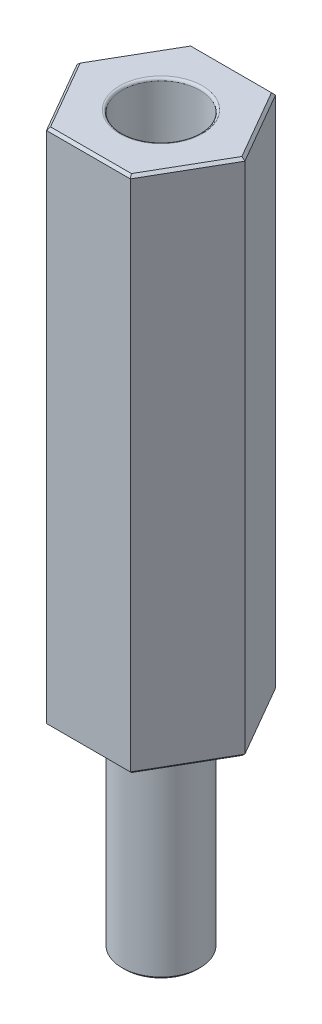
ISO-10303-21;
HEADER;
FILE_DESCRIPTION(('STEP AP214'),'2;1');
FILE_NAME('part.step','',(''),(''),'','','');
FILE_SCHEMA(('AUTOMOTIVE_DESIGN { 1 0 10303 214 1 1 1 1 }'));
ENDSEC;
DATA;
#1=APPLICATION_CONTEXT('core data for automotive mechanical design processes');
#2=APPLICATION_PROTOCOL_DEFINITION('international standard','automotive_design',2000,#1);
#3=PRODUCT_CONTEXT('',#1,'mechanical');
#4=PRODUCT('Part','Part','',(#3));
#5=PRODUCT_RELATED_PRODUCT_CATEGORY('part','',(#4));
#6=PRODUCT_DEFINITION_FORMATION('','',#4);
#7=PRODUCT_DEFINITION_CONTEXT('part definition',#1,'design');
#8=PRODUCT_DEFINITION('design','',#6,#7);
#9=PRODUCT_DEFINITION_SHAPE('','',#8);
#10=(LENGTH_UNIT() NAMED_UNIT(*) SI_UNIT(.MILLI.,.METRE.));
#11=(NAMED_UNIT(*) PLANE_ANGLE_UNIT() SI_UNIT($,.RADIAN.));
#12=(NAMED_UNIT(*) SI_UNIT($,.STERADIAN.) SOLID_ANGLE_UNIT());
#13=UNCERTAINTY_MEASURE_WITH_UNIT(LENGTH_MEASURE(1.E-05),#10,'distance_accuracy_value','');
#14=(GEOMETRIC_REPRESENTATION_CONTEXT(3) GLOBAL_UNCERTAINTY_ASSIGNED_CONTEXT((#13)) GLOBAL_UNIT_ASSIGNED_CONTEXT((#10,
#11,#12)) REPRESENTATION_CONTEXT('',''));
#15=CARTESIAN_POINT('',(0.,0.,0.));
#16=DIRECTION('',(0.,0.,1.));
#17=DIRECTION('',(1.,0.,0.));
#18=AXIS2_PLACEMENT_3D('',#15,#16,#17);
#19=CARTESIAN_POINT('',(1.61658075373097,20.,2.8));
#20=DIRECTION('',(0.,0.,1.));
#21=DIRECTION('',(1.,0.,0.));
#22=AXIS2_PLACEMENT_3D('',#19,#20,#21);
#23=PLANE('',#22);
#24=DIRECTION('',(0.,-1.,0.));
#25=VECTOR('',#24,1.);
#26=CARTESIAN_POINT('',(1.61658075373097,20.,2.8));
#27=LINE('',#26,#25);
#28=CARTESIAN_POINT('',(1.61658075373097,19.9,2.8));
#29=VERTEX_POINT('',#28);
#30=CARTESIAN_POINT('',(1.61658075373097,0.100000000000003,2.8));
#31=VERTEX_POINT('',#30);
#32=EDGE_CURVE('E143',#29,#31,#27,.T.);
#33=ORIENTED_EDGE('',*,*,#32,.F.);
#34=DIRECTION('',(-1.,0.,0.));
#35=VECTOR('',#34,1.);
#36=CARTESIAN_POINT('',(-1.61658075373094,19.9,2.8));
#37=LINE('',#36,#35);
#38=CARTESIAN_POINT('',(-1.61658075373094,19.9,2.8));
#39=VERTEX_POINT('',#38);
#40=EDGE_CURVE('E203',#29,#39,#37,.T.);
#41=ORIENTED_EDGE('',*,*,#40,.T.);
#42=DIRECTION('',(0.,-1.,0.));
#43=VECTOR('',#42,1.);
#44=CARTESIAN_POINT('',(-1.61658075373094,20.,2.8));
#45=LINE('',#44,#43);
#46=CARTESIAN_POINT('',(-1.61658075373094,0.100000000000003,2.8));
#47=VERTEX_POINT('',#46);
#48=EDGE_CURVE('E133',#39,#47,#45,.T.);
#49=ORIENTED_EDGE('',*,*,#48,.T.);
#50=DIRECTION('',(1.,0.,0.));
#51=VECTOR('',#50,1.);
#52=CARTESIAN_POINT('',(1.61658075373097,0.100000000000003,2.8));
#53=LINE('',#52,#51);
#54=EDGE_CURVE('E201',#47,#31,#53,.T.);
#55=ORIENTED_EDGE('',*,*,#54,.T.);
#56=EDGE_LOOP('',(#33,#41,#49,#55));
#57=FACE_BOUND('',#56,.T.);
#58=ADVANCED_FACE('F33',(#57),#23,.T.);
#59=CARTESIAN_POINT('',(3.23316150746192,20.,0.));
#60=DIRECTION('',(0.866025403784439,0.,0.5));
#61=DIRECTION('',(0.5,0.,-0.866025403784439));
#62=AXIS2_PLACEMENT_3D('',#59,#60,#61);
#63=PLANE('',#62);
#64=DIRECTION('',(0.,-1.,0.));
#65=VECTOR('',#64,1.);
#66=CARTESIAN_POINT('',(3.23316150746192,20.,0.));
#67=LINE('',#66,#65);
#68=CARTESIAN_POINT('',(3.23316150746192,19.9,0.));
#69=VERTEX_POINT('',#68);
#70=CARTESIAN_POINT('',(3.23316150746192,0.100000000000003,0.));
#71=VERTEX_POINT('',#70);
#72=EDGE_CURVE('E147',#69,#71,#67,.T.);
#73=ORIENTED_EDGE('',*,*,#72,.F.);
#74=DIRECTION('',(-0.5,0.,0.866025403784439));
#75=VECTOR('',#74,1.);
#76=CARTESIAN_POINT('',(1.61658075373097,19.9,2.8));
#77=LINE('',#76,#75);
#78=EDGE_CURVE('E199',#69,#29,#77,.T.);
#79=ORIENTED_EDGE('',*,*,#78,.T.);
#80=ORIENTED_EDGE('',*,*,#32,.T.);
#81=DIRECTION('',(0.5,0.,-0.866025403784439));
#82=VECTOR('',#81,1.);
#83=CARTESIAN_POINT('',(3.23316150746192,0.100000000000003,0.));
#84=LINE('',#83,#82);
#85=EDGE_CURVE('E197',#31,#71,#84,.T.);
#86=ORIENTED_EDGE('',*,*,#85,.T.);
#87=EDGE_LOOP('',(#73,#79,#80,#86));
#88=FACE_BOUND('',#87,.T.);
#89=ADVANCED_FACE('F260',(#88),#63,.T.);
#90=CARTESIAN_POINT('',(1.61658075373096,20.,-2.8));
#91=DIRECTION('',(0.866025403784438,0.,-0.500000000000002));
#92=DIRECTION('',(-0.500000000000002,0.,-0.866025403784438));
#93=AXIS2_PLACEMENT_3D('',#90,#91,#92);
#94=PLANE('',#93);
#95=DIRECTION('',(0.,-1.,0.));
#96=VECTOR('',#95,1.);
#97=CARTESIAN_POINT('',(1.61658075373096,20.,-2.8));
#98=LINE('',#97,#96);
#99=CARTESIAN_POINT('',(1.61658075373096,19.9,-2.8));
#100=VERTEX_POINT('',#99);
#101=CARTESIAN_POINT('',(1.61658075373096,0.100000000000003,-2.8));
#102=VERTEX_POINT('',#101);
#103=EDGE_CURVE('E150',#100,#102,#98,.T.);
#104=ORIENTED_EDGE('',*,*,#103,.F.);
#105=DIRECTION('',(0.500000000000002,0.,0.866025403784438));
#106=VECTOR('',#105,1.);
#107=CARTESIAN_POINT('',(3.23316150746192,19.9,0.));
#108=LINE('',#107,#106);
#109=EDGE_CURVE('E195',#100,#69,#108,.T.);
#110=ORIENTED_EDGE('',*,*,#109,.T.);
#111=ORIENTED_EDGE('',*,*,#72,.T.);
#112=DIRECTION('',(-0.500000000000002,0.,-0.866025403784438));
#113=VECTOR('',#112,1.);
#114=CARTESIAN_POINT('',(1.61658075373096,0.100000000000003,-2.8));
#115=LINE('',#114,#113);
#116=EDGE_CURVE('E193',#71,#102,#115,.T.);
#117=ORIENTED_EDGE('',*,*,#116,.T.);
#118=EDGE_LOOP('',(#104,#110,#111,#117));
#119=FACE_BOUND('',#118,.T.);
#120=ADVANCED_FACE('F318',(#119),#94,.T.);
#121=CARTESIAN_POINT('',(-1.61658075373094,20.,-2.8));
#122=DIRECTION('',(0.,0.,-1.));
#123=DIRECTION('',(-1.,0.,0.));
#124=AXIS2_PLACEMENT_3D('',#121,#122,#123);
#125=PLANE('',#124);
#126=DIRECTION('',(0.,-1.,0.));
#127=VECTOR('',#126,1.);
#128=CARTESIAN_POINT('',(-1.61658075373094,20.,-2.8));
#129=LINE('',#128,#127);
#130=CARTESIAN_POINT('',(-1.61658075373094,19.9,-2.8));
#131=VERTEX_POINT('',#130);
#132=CARTESIAN_POINT('',(-1.61658075373094,0.100000000000003,-2.8));
#133=VERTEX_POINT('',#132);
#134=EDGE_CURVE('E153',#131,#133,#129,.T.);
#135=ORIENTED_EDGE('',*,*,#134,.F.);
#136=DIRECTION('',(1.,0.,0.));
#137=VECTOR('',#136,1.);
#138=CARTESIAN_POINT('',(1.61658075373096,19.9,-2.8));
#139=LINE('',#138,#137);
#140=EDGE_CURVE('E191',#131,#100,#139,.T.);
#141=ORIENTED_EDGE('',*,*,#140,.T.);
#142=ORIENTED_EDGE('',*,*,#103,.T.);
#143=DIRECTION('',(-1.,0.,0.));
#144=VECTOR('',#143,1.);
#145=CARTESIAN_POINT('',(-1.61658075373094,0.100000000000003,-2.8));
#146=LINE('',#145,#144);
#147=EDGE_CURVE('E188',#102,#133,#146,.T.);
#148=ORIENTED_EDGE('',*,*,#147,.T.);
#149=EDGE_LOOP('',(#135,#141,#142,#148));
#150=FACE_BOUND('',#149,.T.);
#151=ADVANCED_FACE('F285',(#150),#125,.T.);
#152=CARTESIAN_POINT('',(-3.23316150746189,20.,0.));
#153=DIRECTION('',(-0.866025403784439,0.,-0.5));
#154=DIRECTION('',(-0.5,0.,0.866025403784439));
#155=AXIS2_PLACEMENT_3D('',#152,#153,#154);
#156=PLANE('',#155);
#157=DIRECTION('',(0.,-1.,0.));
#158=VECTOR('',#157,1.);
#159=CARTESIAN_POINT('',(-3.23316150746189,20.,0.));
#160=LINE('',#159,#158);
#161=CARTESIAN_POINT('',(-3.23316150746189,19.9,0.));
#162=VERTEX_POINT('',#161);
#163=CARTESIAN_POINT('',(-3.23316150746189,0.100000000000003,0.));
#164=VERTEX_POINT('',#163);
#165=EDGE_CURVE('E137',#162,#164,#160,.T.);
#166=ORIENTED_EDGE('',*,*,#165,.F.);
#167=DIRECTION('',(0.5,0.,-0.866025403784439));
#168=VECTOR('',#167,1.);
#169=CARTESIAN_POINT('',(-1.61658075373094,19.9,-2.8));
#170=LINE('',#169,#168);
#171=EDGE_CURVE('E186',#162,#131,#170,.T.);
#172=ORIENTED_EDGE('',*,*,#171,.T.);
#173=ORIENTED_EDGE('',*,*,#134,.T.);
#174=DIRECTION('',(-0.5,0.,0.866025403784439));
#175=VECTOR('',#174,1.);
#176=CARTESIAN_POINT('',(-3.23316150746189,0.100000000000003,0.));
#177=LINE('',#176,#175);
#178=EDGE_CURVE('E184',#133,#164,#177,.T.);
#179=ORIENTED_EDGE('',*,*,#178,.T.);
#180=EDGE_LOOP('',(#166,#172,#173,#179));
#181=FACE_BOUND('',#180,.T.);
#182=ADVANCED_FACE('F276',(#181),#156,.T.);
#183=CARTESIAN_POINT('',(-1.61658075373094,20.,2.8));
#184=DIRECTION('',(-0.866025403784439,0.,0.5));
#185=DIRECTION('',(0.5,0.,0.866025403784439));
#186=AXIS2_PLACEMENT_3D('',#183,#184,#185);
#187=PLANE('',#186);
#188=ORIENTED_EDGE('',*,*,#48,.F.);
#189=DIRECTION('',(-0.5,0.,-0.866025403784439));
#190=VECTOR('',#189,1.);
#191=CARTESIAN_POINT('',(-3.23316150746189,19.9,0.));
#192=LINE('',#191,#190);
#193=EDGE_CURVE('E168',#39,#162,#192,.T.);
#194=ORIENTED_EDGE('',*,*,#193,.T.);
#195=ORIENTED_EDGE('',*,*,#165,.T.);
#196=DIRECTION('',(0.5,0.,0.866025403784439));
#197=VECTOR('',#196,1.);
#198=CARTESIAN_POINT('',(-1.61658075373094,0.100000000000003,2.8));
#199=LINE('',#198,#197);
#200=EDGE_CURVE('E166',#164,#47,#199,.T.);
#201=ORIENTED_EDGE('',*,*,#200,.T.);
#202=EDGE_LOOP('',(#188,#194,#195,#201));
#203=FACE_BOUND('',#202,.T.);
#204=ADVANCED_FACE('F273',(#203),#187,.T.);
#205=CARTESIAN_POINT('',(0.,20.,0.));
#206=DIRECTION('',(0.,-1.,0.));
#207=DIRECTION('',(0.,0.,-1.));
#208=AXIS2_PLACEMENT_3D('',#205,#206,#207);
#209=PLANE('',#208);
#210=DIRECTION('',(-0.5,0.,0.866025403784439));
#211=VECTOR('',#210,1.);
#212=CARTESIAN_POINT('',(-3.14655896708345,20.,0.0499999999999996));
#213=LINE('',#212,#211);
#214=CARTESIAN_POINT('',(-1.55884572681198,20.,-2.7));
#215=VERTEX_POINT('',#214);
#216=CARTESIAN_POINT('',(-3.11769145362397,20.,0.));
#217=VERTEX_POINT('',#216);
#218=EDGE_CURVE('E179',#215,#217,#213,.T.);
#219=ORIENTED_EDGE('',*,*,#218,.T.);
#220=DIRECTION('',(0.5,0.,0.866025403784439));
#221=VECTOR('',#220,1.);
#222=CARTESIAN_POINT('',(-1.5299782133525,20.,2.75));
#223=LINE('',#222,#221);
#224=CARTESIAN_POINT('',(-1.55884572681198,20.,2.7));
#225=VERTEX_POINT('',#224);
#226=EDGE_CURVE('E181',#217,#225,#223,.T.);
#227=ORIENTED_EDGE('',*,*,#226,.T.);
#228=DIRECTION('',(1.,0.,0.));
#229=VECTOR('',#228,1.);
#230=CARTESIAN_POINT('',(1.61658075373097,20.,2.7));
#231=LINE('',#230,#229);
#232=CARTESIAN_POINT('',(1.55884572681201,20.,2.7));
#233=VERTEX_POINT('',#232);
#234=EDGE_CURVE('E171',#225,#233,#231,.T.);
#235=ORIENTED_EDGE('',*,*,#234,.T.);
#236=DIRECTION('',(0.5,0.,-0.866025403784439));
#237=VECTOR('',#236,1.);
#238=CARTESIAN_POINT('',(3.14655896708348,20.,-0.0500000000000003));
#239=LINE('',#238,#237);
#240=CARTESIAN_POINT('',(3.117691453624,20.,0.));
#241=VERTEX_POINT('',#240);
#242=EDGE_CURVE('E173',#233,#241,#239,.T.);
#243=ORIENTED_EDGE('',*,*,#242,.T.);
#244=DIRECTION('',(-0.500000000000002,0.,-0.866025403784438));
#245=VECTOR('',#244,1.);
#246=CARTESIAN_POINT('',(1.52997821335252,20.,-2.75));
#247=LINE('',#246,#245);
#248=CARTESIAN_POINT('',(1.558845726812,20.,-2.7));
#249=VERTEX_POINT('',#248);
#250=EDGE_CURVE('E175',#241,#249,#247,.T.);
#251=ORIENTED_EDGE('',*,*,#250,.T.);
#252=DIRECTION('',(-1.,0.,0.));
#253=VECTOR('',#252,1.);
#254=CARTESIAN_POINT('',(-1.61658075373094,20.,-2.7));
#255=LINE('',#254,#253);
#256=EDGE_CURVE('E177',#249,#215,#255,.T.);
#257=ORIENTED_EDGE('',*,*,#256,.T.);
#258=EDGE_LOOP('',(#219,#227,#235,#243,#251,#257));
#259=FACE_BOUND('',#258,.T.);
#260=CARTESIAN_POINT('',(0.,20.,0.));
#261=DIRECTION('',(0.,-1.,0.));
#262=DIRECTION('',(0.,0.,-1.));
#263=AXIS2_PLACEMENT_3D('',#260,#261,#262);
#264=CIRCLE('',#263,1.6);
#265=CARTESIAN_POINT('',(0.,20.,-1.6));
#266=VERTEX_POINT('',#265);
#267=EDGE_CURVE('E163',#266,#266,#264,.T.);
#268=ORIENTED_EDGE('',*,*,#267,.T.);
#269=EDGE_LOOP('',(#268));
#270=FACE_BOUND('',#269,.T.);
#271=ADVANCED_FACE('F300',(#259,#270),#209,.F.);
#272=CARTESIAN_POINT('',(0.,0.,0.));
#273=DIRECTION('',(0.,-1.,0.));
#274=DIRECTION('',(0.,0.,-1.));
#275=AXIS2_PLACEMENT_3D('',#272,#273,#274);
#276=PLANE('',#275);
#277=DIRECTION('',(0.5,0.,-0.866025403784439));
#278=VECTOR('',#277,1.);
#279=CARTESIAN_POINT('',(-2.33826859021797,0.,-1.34999999999999));
#280=LINE('',#279,#278);
#281=CARTESIAN_POINT('',(-3.11769145362396,0.,0.));
#282=VERTEX_POINT('',#281);
#283=CARTESIAN_POINT('',(-1.55884572681198,0.,-2.7));
#284=VERTEX_POINT('',#283);
#285=EDGE_CURVE('E42',#282,#284,#280,.T.);
#286=ORIENTED_EDGE('',*,*,#285,.T.);
#287=DIRECTION('',(1.,0.,0.));
#288=VECTOR('',#287,1.);
#289=CARTESIAN_POINT('',(0.,0.,-2.7));
#290=LINE('',#289,#288);
#291=CARTESIAN_POINT('',(1.558845726812,0.,-2.7));
#292=VERTEX_POINT('',#291);
#293=EDGE_CURVE('E11',#284,#292,#290,.T.);
#294=ORIENTED_EDGE('',*,*,#293,.T.);
#295=DIRECTION('',(0.500000000000002,0.,0.866025403784438));
#296=VECTOR('',#295,1.);
#297=CARTESIAN_POINT('',(2.33826859021799,0.,-1.35000000000001));
#298=LINE('',#297,#296);
#299=CARTESIAN_POINT('',(3.11769145362399,0.,0.));
#300=VERTEX_POINT('',#299);
#301=EDGE_CURVE('E213',#292,#300,#298,.T.);
#302=ORIENTED_EDGE('',*,*,#301,.T.);
#303=DIRECTION('',(-0.5,0.,0.866025403784439));
#304=VECTOR('',#303,1.);
#305=CARTESIAN_POINT('',(2.338268590218,0.,1.35000000000001));
#306=LINE('',#305,#304);
#307=CARTESIAN_POINT('',(1.55884572681201,0.,2.7));
#308=VERTEX_POINT('',#307);
#309=EDGE_CURVE('E211',#300,#308,#306,.T.);
#310=ORIENTED_EDGE('',*,*,#309,.T.);
#311=DIRECTION('',(-1.,0.,0.));
#312=VECTOR('',#311,1.);
#313=CARTESIAN_POINT('',(0.,0.,2.7));
#314=LINE('',#313,#312);
#315=CARTESIAN_POINT('',(-1.55884572681198,0.,2.7));
#316=VERTEX_POINT('',#315);
#317=EDGE_CURVE('E215',#308,#316,#314,.T.);
#318=ORIENTED_EDGE('',*,*,#317,.T.);
#319=DIRECTION('',(-0.5,0.,-0.866025403784439));
#320=VECTOR('',#319,1.);
#321=CARTESIAN_POINT('',(-2.33826859021797,0.,1.34999999999999));
#322=LINE('',#321,#320);
#323=EDGE_CURVE('E53',#316,#282,#322,.T.);
#324=ORIENTED_EDGE('',*,*,#323,.T.);
#325=EDGE_LOOP('',(#286,#294,#302,#310,#318,#324));
#326=FACE_BOUND('',#325,.T.);
#327=CARTESIAN_POINT('',(0.,0.,0.));
#328=DIRECTION('',(0.,-1.,0.));
#329=DIRECTION('',(0.,0.,-1.));
#330=AXIS2_PLACEMENT_3D('',#327,#328,#329);
#331=CIRCLE('',#330,1.5);
#332=CARTESIAN_POINT('',(0.,0.,-1.5));
#333=VERTEX_POINT('',#332);
#334=EDGE_CURVE('E146',#333,#333,#331,.T.);
#335=ORIENTED_EDGE('',*,*,#334,.F.);
#336=EDGE_LOOP('',(#335));
#337=FACE_BOUND('',#336,.T.);
#338=ADVANCED_FACE('F296',(#326,#337),#276,.T.);
#339=CARTESIAN_POINT('',(0.,0.,0.));
#340=DIRECTION('',(0.,-1.,0.));
#341=DIRECTION('',(1.,0.,0.));
#342=AXIS2_PLACEMENT_3D('',#339,#340,#341);
#343=CYLINDRICAL_SURFACE('',#342,1.5);
#344=CARTESIAN_POINT('',(0.,-7.9,0.));
#345=DIRECTION('',(0.,-1.,0.));
#346=DIRECTION('',(1.,0.,0.));
#347=AXIS2_PLACEMENT_3D('',#344,#345,#346);
#348=CIRCLE('',#347,1.5);
#349=CARTESIAN_POINT('',(1.5,-7.9,0.));
#350=VERTEX_POINT('',#349);
#351=EDGE_CURVE('E208',#350,#350,#348,.F.);
#352=ORIENTED_EDGE('',*,*,#351,.T.);
#353=EDGE_LOOP('',(#352));
#354=FACE_BOUND('',#353,.T.);
#355=ORIENTED_EDGE('',*,*,#334,.T.);
#356=EDGE_LOOP('',(#355));
#357=FACE_BOUND('',#356,.T.);
#358=ADVANCED_FACE('F299',(#354,#357),#343,.T.);
#359=CARTESIAN_POINT('',(0.,-8.,0.));
#360=DIRECTION('',(0.,-1.,0.));
#361=DIRECTION('',(1.,0.,0.));
#362=AXIS2_PLACEMENT_3D('',#359,#360,#361);
#363=PLANE('',#362);
#364=CARTESIAN_POINT('',(0.,-8.,0.));
#365=DIRECTION('',(0.,-1.,0.));
#366=DIRECTION('',(1.,0.,0.));
#367=AXIS2_PLACEMENT_3D('',#364,#365,#366);
#368=CIRCLE('',#367,1.4);
#369=CARTESIAN_POINT('',(1.4,-8.,0.));
#370=VERTEX_POINT('',#369);
#371=EDGE_CURVE('E205',#370,#370,#368,.T.);
#372=ORIENTED_EDGE('',*,*,#371,.T.);
#373=EDGE_LOOP('',(#372));
#374=FACE_BOUND('',#373,.T.);
#375=ADVANCED_FACE('F127',(#374),#363,.T.);
#376=CARTESIAN_POINT('',(0.,12.,0.));
#377=DIRECTION('',(0.,1.,0.));
#378=DIRECTION('',(0.,0.,1.));
#379=AXIS2_PLACEMENT_3D('',#376,#377,#378);
#380=CONICAL_SURFACE('',#379,1.5,1.02974425867665);
#381=CARTESIAN_POINT('',(0.,11.0987090714587,0.));
#382=VERTEX_POINT('',#381);
#383=VERTEX_LOOP('',#382);
#384=FACE_BOUND('',#383,.T.);
#385=CARTESIAN_POINT('',(0.,12.,0.));
#386=DIRECTION('',(0.,1.,0.));
#387=DIRECTION('',(0.,0.,1.));
#388=AXIS2_PLACEMENT_3D('',#385,#386,#387);
#389=CIRCLE('',#388,1.5);
#390=CARTESIAN_POINT('',(0.,12.,1.5));
#391=VERTEX_POINT('',#390);
#392=EDGE_CURVE('E131',#391,#391,#389,.T.);
#393=ORIENTED_EDGE('',*,*,#392,.T.);
#394=EDGE_LOOP('',(#393));
#395=FACE_BOUND('',#394,.T.);
#396=ADVANCED_FACE('F123',(#384,#395),#380,.F.);
#397=CARTESIAN_POINT('',(0.,20.,0.));
#398=DIRECTION('',(0.,1.,0.));
#399=DIRECTION('',(0.,0.,1.));
#400=AXIS2_PLACEMENT_3D('',#397,#398,#399);
#401=CYLINDRICAL_SURFACE('',#400,1.5);
#402=CARTESIAN_POINT('',(0.,19.9,0.));
#403=DIRECTION('',(0.,-1.,0.));
#404=DIRECTION('',(0.,0.,-1.));
#405=AXIS2_PLACEMENT_3D('',#402,#403,#404);
#406=CIRCLE('',#405,1.5);
#407=CARTESIAN_POINT('',(0.,19.9,-1.5));
#408=VERTEX_POINT('',#407);
#409=EDGE_CURVE('E160',#408,#408,#406,.F.);
#410=ORIENTED_EDGE('',*,*,#409,.T.);
#411=EDGE_LOOP('',(#410));
#412=FACE_BOUND('',#411,.T.);
#413=ORIENTED_EDGE('',*,*,#392,.F.);
#414=EDGE_LOOP('',(#413));
#415=FACE_BOUND('',#414,.T.);
#416=ADVANCED_FACE('F126',(#412,#415),#401,.F.);
#417=CARTESIAN_POINT('',(0.,19.9,0.));
#418=DIRECTION('',(0.,-1.,0.));
#419=DIRECTION('',(0.,0.,-1.));
#420=AXIS2_PLACEMENT_3D('',#417,#418,#419);
#421=TOROIDAL_SURFACE('',#420,1.6,0.1);
#422=ORIENTED_EDGE('',*,*,#267,.F.);
#423=EDGE_LOOP('',(#422));
#424=FACE_BOUND('',#423,.T.);
#425=ORIENTED_EDGE('',*,*,#409,.F.);
#426=EDGE_LOOP('',(#425));
#427=FACE_BOUND('',#426,.T.);
#428=ADVANCED_FACE('F323',(#424,#427),#421,.T.);
#429=CARTESIAN_POINT('',(1.61658075373096,19.9,-2.8));
#430=DIRECTION('',(0.612372435695794,0.707106781186547,-0.353553390593275));
#431=DIRECTION('',(-0.500000000000002,0.,-0.866025403784438));
#432=AXIS2_PLACEMENT_3D('',#429,#430,#431);
#433=PLANE('',#432);
#434=DIRECTION('',(-0.377964473009227,0.654653670707978,0.654653670707977));
#435=VECTOR('',#434,1.);
#436=CARTESIAN_POINT('',(1.61658075373096,19.9,-2.8));
#437=LINE('',#436,#435);
#438=EDGE_CURVE('E140',#249,#100,#437,.F.);
#439=ORIENTED_EDGE('',*,*,#438,.F.);
#440=ORIENTED_EDGE('',*,*,#250,.F.);
#441=DIRECTION('',(-0.755928946018454,0.654653670707978,0.));
#442=VECTOR('',#441,1.);
#443=CARTESIAN_POINT('',(3.23316150746192,19.9,0.));
#444=LINE('',#443,#442);
#445=EDGE_CURVE('E134',#69,#241,#444,.T.);
#446=ORIENTED_EDGE('',*,*,#445,.F.);
#447=ORIENTED_EDGE('',*,*,#109,.F.);
#448=EDGE_LOOP('',(#439,#440,#446,#447));
#449=FACE_BOUND('',#448,.T.);
#450=ADVANCED_FACE('F326',(#449),#433,.T.);
#451=CARTESIAN_POINT('',(3.23316150746192,19.9,0.));
#452=DIRECTION('',(0.612372435695795,0.707106781186547,0.353553390593274));
#453=DIRECTION('',(0.5,0.,-0.866025403784439));
#454=AXIS2_PLACEMENT_3D('',#451,#452,#453);
#455=PLANE('',#454);
#456=ORIENTED_EDGE('',*,*,#445,.T.);
#457=ORIENTED_EDGE('',*,*,#242,.F.);
#458=DIRECTION('',(-0.377964473009226,0.654653670707978,-0.654653670707978));
#459=VECTOR('',#458,1.);
#460=CARTESIAN_POINT('',(1.61658075373097,19.9,2.8));
#461=LINE('',#460,#459);
#462=EDGE_CURVE('E226',#29,#233,#461,.T.);
#463=ORIENTED_EDGE('',*,*,#462,.F.);
#464=ORIENTED_EDGE('',*,*,#78,.F.);
#465=EDGE_LOOP('',(#456,#457,#463,#464));
#466=FACE_BOUND('',#465,.T.);
#467=ADVANCED_FACE('F264',(#466),#455,.T.);
#468=CARTESIAN_POINT('',(-1.61658075373094,19.9,-2.8));
#469=DIRECTION('',(0.,0.707106781186547,-0.707106781186548));
#470=DIRECTION('',(-1.,0.,0.));
#471=AXIS2_PLACEMENT_3D('',#468,#469,#470);
#472=PLANE('',#471);
#473=ORIENTED_EDGE('',*,*,#438,.T.);
#474=ORIENTED_EDGE('',*,*,#140,.F.);
#475=DIRECTION('',(0.377964473009228,0.654653670707978,0.654653670707976));
#476=VECTOR('',#475,1.);
#477=CARTESIAN_POINT('',(-1.61658075373094,19.9,-2.8));
#478=LINE('',#477,#476);
#479=EDGE_CURVE('E223',#215,#131,#478,.F.);
#480=ORIENTED_EDGE('',*,*,#479,.F.);
#481=ORIENTED_EDGE('',*,*,#256,.F.);
#482=EDGE_LOOP('',(#473,#474,#480,#481));
#483=FACE_BOUND('',#482,.T.);
#484=ADVANCED_FACE('F339',(#483),#472,.T.);
#485=CARTESIAN_POINT('',(1.61658075373097,19.9,2.8));
#486=DIRECTION('',(0.,0.707106781186548,0.707106781186548));
#487=DIRECTION('',(1.,0.,0.));
#488=AXIS2_PLACEMENT_3D('',#485,#486,#487);
#489=PLANE('',#488);
#490=ORIENTED_EDGE('',*,*,#462,.T.);
#491=ORIENTED_EDGE('',*,*,#234,.F.);
#492=DIRECTION('',(-0.377964473009226,-0.654653670707978,0.654653670707978));
#493=VECTOR('',#492,1.);
#494=CARTESIAN_POINT('',(-1.15470053837924,20.7,2.));
#495=LINE('',#494,#493);
#496=EDGE_CURVE('E221',#39,#225,#495,.F.);
#497=ORIENTED_EDGE('',*,*,#496,.F.);
#498=ORIENTED_EDGE('',*,*,#40,.F.);
#499=EDGE_LOOP('',(#490,#491,#497,#498));
#500=FACE_BOUND('',#499,.T.);
#501=ADVANCED_FACE('F270',(#500),#489,.T.);
#502=CARTESIAN_POINT('',(-3.23316150746189,19.9,0.));
#503=DIRECTION('',(-0.612372435695795,0.707106781186547,-0.353553390593274));
#504=DIRECTION('',(-0.5,0.,0.866025403784439));
#505=AXIS2_PLACEMENT_3D('',#502,#503,#504);
#506=PLANE('',#505);
#507=ORIENTED_EDGE('',*,*,#479,.T.);
#508=ORIENTED_EDGE('',*,*,#171,.F.);
#509=DIRECTION('',(0.755928946018454,0.654653670707978,0.));
#510=VECTOR('',#509,1.);
#511=CARTESIAN_POINT('',(-3.23316150746189,19.9,0.));
#512=LINE('',#511,#510);
#513=EDGE_CURVE('E219',#217,#162,#512,.F.);
#514=ORIENTED_EDGE('',*,*,#513,.F.);
#515=ORIENTED_EDGE('',*,*,#218,.F.);
#516=EDGE_LOOP('',(#507,#508,#514,#515));
#517=FACE_BOUND('',#516,.T.);
#518=ADVANCED_FACE('F332',(#517),#506,.T.);
#519=CARTESIAN_POINT('',(-1.61658075373094,19.9,2.8));
#520=DIRECTION('',(-0.612372435695795,0.707106781186547,0.353553390593274));
#521=DIRECTION('',(0.5,0.,0.866025403784439));
#522=AXIS2_PLACEMENT_3D('',#519,#520,#521);
#523=PLANE('',#522);
#524=ORIENTED_EDGE('',*,*,#496,.T.);
#525=ORIENTED_EDGE('',*,*,#226,.F.);
#526=ORIENTED_EDGE('',*,*,#513,.T.);
#527=ORIENTED_EDGE('',*,*,#193,.F.);
#528=EDGE_LOOP('',(#524,#525,#526,#527));
#529=FACE_BOUND('',#528,.T.);
#530=ADVANCED_FACE('F328',(#529),#523,.T.);
#531=CARTESIAN_POINT('',(0.,-8.,0.));
#532=DIRECTION('',(0.,1.,0.));
#533=DIRECTION('',(-1.,0.,0.));
#534=AXIS2_PLACEMENT_3D('',#531,#532,#533);
#535=CONICAL_SURFACE('',#534,1.4,0.785398163397442);
#536=ORIENTED_EDGE('',*,*,#351,.F.);
#537=EDGE_LOOP('',(#536));
#538=FACE_BOUND('',#537,.T.);
#539=ORIENTED_EDGE('',*,*,#371,.F.);
#540=EDGE_LOOP('',(#539));
#541=FACE_BOUND('',#540,.T.);
#542=ADVANCED_FACE('F331',(#538,#541),#535,.T.);
#543=CARTESIAN_POINT('',(0.,0.,2.7));
#544=DIRECTION('',(0.,0.707106781186541,-0.707106781186554));
#545=DIRECTION('',(-1.,0.,0.));
#546=AXIS2_PLACEMENT_3D('',#543,#544,#545);
#547=PLANE('',#546);
#548=DIRECTION('',(-0.377964473009225,-0.654653670707983,-0.654653670707972));
#549=VECTOR('',#548,1.);
#550=CARTESIAN_POINT('',(1.33615348012458,-0.385714285714284,2.31428571428572));
#551=LINE('',#550,#549);
#552=EDGE_CURVE('E240',#31,#308,#551,.T.);
#553=ORIENTED_EDGE('',*,*,#552,.F.);
#554=ORIENTED_EDGE('',*,*,#54,.F.);
#555=DIRECTION('',(0.377964473009225,-0.654653670707984,-0.654653670707972));
#556=VECTOR('',#555,1.);
#557=CARTESIAN_POINT('',(-1.33615348012455,-0.385714285714284,2.31428571428572));
#558=LINE('',#557,#556);
#559=EDGE_CURVE('E37',#316,#47,#558,.F.);
#560=ORIENTED_EDGE('',*,*,#559,.F.);
#561=ORIENTED_EDGE('',*,*,#317,.F.);
#562=EDGE_LOOP('',(#553,#554,#560,#561));
#563=FACE_BOUND('',#562,.T.);
#564=ADVANCED_FACE('F35',(#563),#547,.F.);
#565=CARTESIAN_POINT('',(-2.33826859021797,0.,1.34999999999999));
#566=DIRECTION('',(0.6123724356958,0.707106781186541,-0.353553390593277));
#567=DIRECTION('',(-0.5,0.,-0.866025403784439));
#568=AXIS2_PLACEMENT_3D('',#565,#566,#567);
#569=PLANE('',#568);
#570=ORIENTED_EDGE('',*,*,#559,.T.);
#571=ORIENTED_EDGE('',*,*,#200,.F.);
#572=DIRECTION('',(0.755928946018449,-0.654653670707984,0.));
#573=VECTOR('',#572,1.);
#574=CARTESIAN_POINT('',(-2.67230696024912,-0.385714285714284,0.));
#575=LINE('',#574,#573);
#576=EDGE_CURVE('E238',#282,#164,#575,.F.);
#577=ORIENTED_EDGE('',*,*,#576,.F.);
#578=ORIENTED_EDGE('',*,*,#323,.F.);
#579=EDGE_LOOP('',(#570,#571,#577,#578));
#580=FACE_BOUND('',#579,.T.);
#581=ADVANCED_FACE('F250',(#580),#569,.F.);
#582=CARTESIAN_POINT('',(2.338268590218,0.,1.35000000000001));
#583=DIRECTION('',(-0.6123724356958,0.707106781186542,-0.353553390593276));
#584=DIRECTION('',(-0.5,0.,0.866025403784439));
#585=AXIS2_PLACEMENT_3D('',#582,#583,#584);
#586=PLANE('',#585);
#587=ORIENTED_EDGE('',*,*,#552,.T.);
#588=ORIENTED_EDGE('',*,*,#309,.F.);
#589=DIRECTION('',(0.755928946018449,0.654653670707984,0.));
#590=VECTOR('',#589,1.);
#591=CARTESIAN_POINT('',(2.67230696024915,-0.385714285714287,0.));
#592=LINE('',#591,#590);
#593=EDGE_CURVE('E235',#71,#300,#592,.F.);
#594=ORIENTED_EDGE('',*,*,#593,.F.);
#595=ORIENTED_EDGE('',*,*,#85,.F.);
#596=EDGE_LOOP('',(#587,#588,#594,#595));
#597=FACE_BOUND('',#596,.T.);
#598=ADVANCED_FACE('F357',(#597),#586,.F.);
#599=CARTESIAN_POINT('',(-2.33826859021797,0.,-1.34999999999999));
#600=DIRECTION('',(0.6123724356958,0.707106781186541,0.353553390593277));
#601=DIRECTION('',(0.5,0.,-0.866025403784439));
#602=AXIS2_PLACEMENT_3D('',#599,#600,#601);
#603=PLANE('',#602);
#604=ORIENTED_EDGE('',*,*,#576,.T.);
#605=ORIENTED_EDGE('',*,*,#178,.F.);
#606=DIRECTION('',(0.377964473009226,-0.654653670707984,0.654653670707971));
#607=VECTOR('',#606,1.);
#608=CARTESIAN_POINT('',(-1.33615348012455,-0.385714285714288,-2.31428571428572));
#609=LINE('',#608,#607);
#610=EDGE_CURVE('E233',#284,#133,#609,.F.);
#611=ORIENTED_EDGE('',*,*,#610,.F.);
#612=ORIENTED_EDGE('',*,*,#285,.F.);
#613=EDGE_LOOP('',(#604,#605,#611,#612));
#614=FACE_BOUND('',#613,.T.);
#615=ADVANCED_FACE('F281',(#614),#603,.F.);
#616=CARTESIAN_POINT('',(2.33826859021799,0.,-1.35000000000001));
#617=DIRECTION('',(-0.6123724356958,0.707106781186541,0.353553390593278));
#618=DIRECTION('',(0.500000000000002,0.,0.866025403784438));
#619=AXIS2_PLACEMENT_3D('',#616,#617,#618);
#620=PLANE('',#619);
#621=ORIENTED_EDGE('',*,*,#593,.T.);
#622=ORIENTED_EDGE('',*,*,#301,.F.);
#623=DIRECTION('',(0.377964473009223,0.654653670707985,-0.654653670707972));
#624=VECTOR('',#623,1.);
#625=CARTESIAN_POINT('',(1.33615348012458,-0.385714285714284,-2.31428571428572));
#626=LINE('',#625,#624);
#627=EDGE_CURVE('E231',#102,#292,#626,.F.);
#628=ORIENTED_EDGE('',*,*,#627,.F.);
#629=ORIENTED_EDGE('',*,*,#116,.F.);
#630=EDGE_LOOP('',(#621,#622,#628,#629));
#631=FACE_BOUND('',#630,.T.);
#632=ADVANCED_FACE('F294',(#631),#620,.F.);
#633=CARTESIAN_POINT('',(0.,0.,-2.7));
#634=DIRECTION('',(0.,0.707106781186541,0.707106781186554));
#635=DIRECTION('',(1.,0.,0.));
#636=AXIS2_PLACEMENT_3D('',#633,#634,#635);
#637=PLANE('',#636);
#638=ORIENTED_EDGE('',*,*,#610,.T.);
#639=ORIENTED_EDGE('',*,*,#147,.F.);
#640=ORIENTED_EDGE('',*,*,#627,.T.);
#641=ORIENTED_EDGE('',*,*,#293,.F.);
#642=EDGE_LOOP('',(#638,#639,#640,#641));
#643=FACE_BOUND('',#642,.T.);
#644=ADVANCED_FACE('F290',(#643),#637,.F.);
#645=CLOSED_SHELL('',(#58,#89,#120,#151,#182,#204,#271,#338,#358,#375,#396,#416,#428,#450,#467,
#484,#501,#518,#530,#542,#564,#581,#598,#615,#632,#644));
#646=MANIFOLD_SOLID_BREP('B2',#645);
#647=ADVANCED_BREP_SHAPE_REPRESENTATION('',(#18,#646),#14);
#648=SHAPE_DEFINITION_REPRESENTATION(#9,#647);
ENDSEC;
END-ISO-10303-21;
